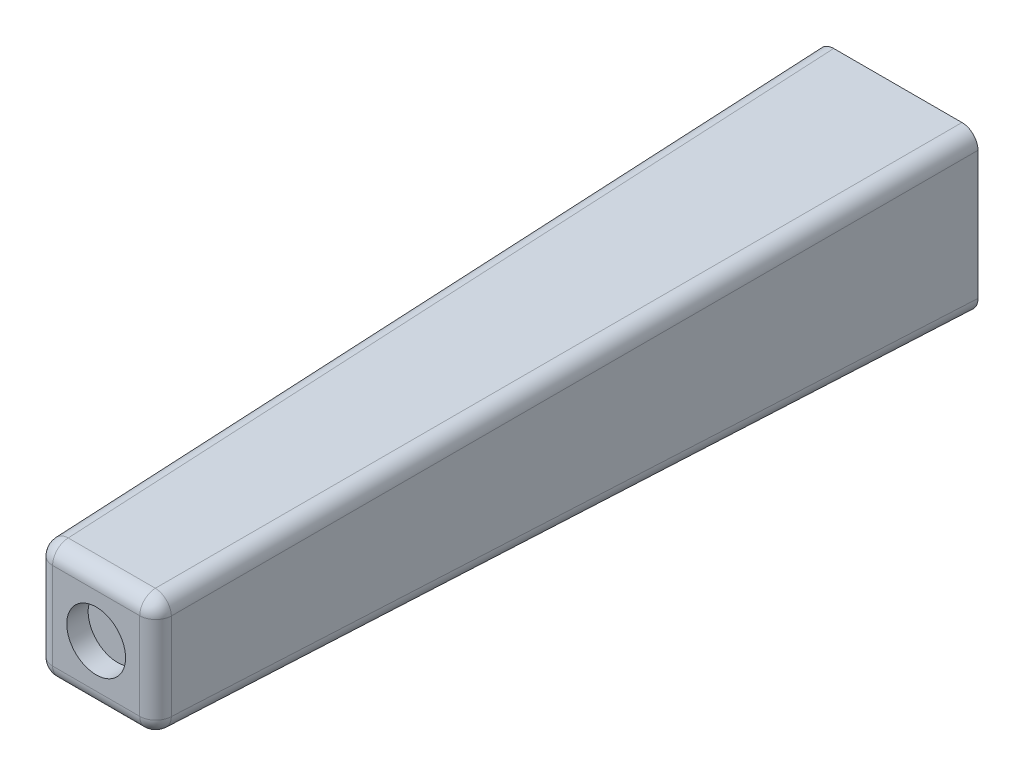
ISO-10303-21;
HEADER;
FILE_DESCRIPTION(('STEP AP214'),'2;1');
FILE_NAME('part.step','',(''),(''),'','','');
FILE_SCHEMA(('AUTOMOTIVE_DESIGN { 1 0 10303 214 1 1 1 1 }'));
ENDSEC;
DATA;
#1=APPLICATION_CONTEXT('core data for automotive mechanical design processes');
#2=APPLICATION_PROTOCOL_DEFINITION('international standard','automotive_design',2000,#1);
#3=PRODUCT_CONTEXT('',#1,'mechanical');
#4=PRODUCT('Part','Part','',(#3));
#5=PRODUCT_RELATED_PRODUCT_CATEGORY('part','',(#4));
#6=PRODUCT_DEFINITION_FORMATION('','',#4);
#7=PRODUCT_DEFINITION_CONTEXT('part definition',#1,'design');
#8=PRODUCT_DEFINITION('design','',#6,#7);
#9=PRODUCT_DEFINITION_SHAPE('','',#8);
#10=(LENGTH_UNIT() NAMED_UNIT(*) SI_UNIT(.MILLI.,.METRE.));
#11=(NAMED_UNIT(*) PLANE_ANGLE_UNIT() SI_UNIT($,.RADIAN.));
#12=(NAMED_UNIT(*) SI_UNIT($,.STERADIAN.) SOLID_ANGLE_UNIT());
#13=UNCERTAINTY_MEASURE_WITH_UNIT(LENGTH_MEASURE(1.E-05),#10,'distance_accuracy_value','');
#14=(GEOMETRIC_REPRESENTATION_CONTEXT(3) GLOBAL_UNCERTAINTY_ASSIGNED_CONTEXT((#13)) GLOBAL_UNIT_ASSIGNED_CONTEXT((#10,
#11,#12)) REPRESENTATION_CONTEXT('',''));
#15=CARTESIAN_POINT('',(0.,0.,0.));
#16=DIRECTION('',(0.,0.,1.));
#17=DIRECTION('',(1.,0.,0.));
#18=AXIS2_PLACEMENT_3D('',#15,#16,#17);
#19=CARTESIAN_POINT('',(7.5,-7.5,0.));
#20=DIRECTION('',(0.999657324975557,0.,0.0261769483078732));
#21=DIRECTION('',(0.0261769483078732,0.,-0.999657324975557));
#22=AXIS2_PLACEMENT_3D('',#19,#20,#21);
#23=PLANE('',#22);
#24=DIRECTION('',(0.,1.,0.));
#25=VECTOR('',#24,1.);
#26=CARTESIAN_POINT('',(7.5,-7.5,0.));
#27=LINE('',#26,#25);
#28=CARTESIAN_POINT('',(7.5,-6.00051401253666,0.));
#29=VERTEX_POINT('',#28);
#30=CARTESIAN_POINT('',(7.5,6.00051401253666,0.));
#31=VERTEX_POINT('',#30);
#32=EDGE_CURVE('E300',#29,#31,#27,.T.);
#33=ORIENTED_EDGE('',*,*,#32,.T.);
#34=DIRECTION('',(-0.0261679842649794,-0.0261679842649794,0.99931500198837));
#35=VECTOR('',#34,1.);
#36=CARTESIAN_POINT('',(7.49075534211638,5.99126935465305,0.353039241303446));
#37=LINE('',#36,#35);
#38=CARTESIAN_POINT('',(5.57430656339179,4.07482057592846,73.5392654224618));
#39=VERTEX_POINT('',#38);
#40=EDGE_CURVE('E167',#31,#39,#37,.T.);
#41=ORIENTED_EDGE('',*,*,#40,.T.);
#42=DIRECTION('',(0.,1.,0.));
#43=VECTOR('',#42,1.);
#44=CARTESIAN_POINT('',(5.57430656339179,-7.5,73.5392654224618));
#45=LINE('',#44,#43);
#46=CARTESIAN_POINT('',(5.57430656339179,-4.07482057592845,73.5392654224618));
#47=VERTEX_POINT('',#46);
#48=EDGE_CURVE('E165',#39,#47,#45,.F.);
#49=ORIENTED_EDGE('',*,*,#48,.T.);
#50=DIRECTION('',(-0.0261679842649794,0.0261679842649794,0.99931500198837));
#51=VECTOR('',#50,1.);
#52=CARTESIAN_POINT('',(7.50102679312377,-6.00154080566043,-0.0392116474133964));
#53=LINE('',#52,#51);
#54=EDGE_CURVE('E163',#47,#29,#53,.F.);
#55=ORIENTED_EDGE('',*,*,#54,.T.);
#56=EDGE_LOOP('',(#33,#41,#49,#55));
#57=FACE_BOUND('',#56,.T.);
#58=ADVANCED_FACE('F41',(#57),#23,.T.);
#59=CARTESIAN_POINT('',(-7.5,7.5,0.));
#60=DIRECTION('',(0.,0.999657324975557,0.0261769483078732));
#61=DIRECTION('',(0.,-0.0261769483078732,0.999657324975557));
#62=AXIS2_PLACEMENT_3D('',#59,#60,#61);
#63=PLANE('',#62);
#64=DIRECTION('',(-1.,0.,0.));
#65=VECTOR('',#64,1.);
#66=CARTESIAN_POINT('',(-7.5,5.57430656339179,73.5392654224618));
#67=LINE('',#66,#65);
#68=CARTESIAN_POINT('',(-4.07482057592845,5.57430656339179,73.5392654224618));
#69=VERTEX_POINT('',#68);
#70=CARTESIAN_POINT('',(4.07482057592846,5.57430656339179,73.5392654224618));
#71=VERTEX_POINT('',#70);
#72=EDGE_CURVE('E125',#69,#71,#67,.F.);
#73=ORIENTED_EDGE('',*,*,#72,.T.);
#74=DIRECTION('',(-0.0261679842649794,-0.0261679842649794,0.99931500198837));
#75=VECTOR('',#74,1.);
#76=CARTESIAN_POINT('',(5.99126935465305,7.49075534211638,0.353039241303446));
#77=LINE('',#76,#75);
#78=CARTESIAN_POINT('',(6.00051401253666,7.5,0.));
#79=VERTEX_POINT('',#78);
#80=EDGE_CURVE('E161',#71,#79,#77,.F.);
#81=ORIENTED_EDGE('',*,*,#80,.T.);
#82=DIRECTION('',(-1.,0.,0.));
#83=VECTOR('',#82,1.);
#84=CARTESIAN_POINT('',(-7.5,7.5,0.));
#85=LINE('',#84,#83);
#86=CARTESIAN_POINT('',(-6.00051401253666,7.5,0.));
#87=VERTEX_POINT('',#86);
#88=EDGE_CURVE('E305',#79,#87,#85,.T.);
#89=ORIENTED_EDGE('',*,*,#88,.T.);
#90=DIRECTION('',(0.0261679842649794,-0.0261679842649794,0.99931500198837));
#91=VECTOR('',#90,1.);
#92=CARTESIAN_POINT('',(-6.00154080566043,7.50102679312376,-0.0392116474133964));
#93=LINE('',#92,#91);
#94=EDGE_CURVE('E154',#87,#69,#93,.T.);
#95=ORIENTED_EDGE('',*,*,#94,.T.);
#96=EDGE_LOOP('',(#73,#81,#89,#95));
#97=FACE_BOUND('',#96,.T.);
#98=ADVANCED_FACE('F225',(#97),#63,.T.);
#99=CARTESIAN_POINT('',(-7.5,-7.5,0.));
#100=DIRECTION('',(-0.999657324975557,0.,0.0261769483078732));
#101=DIRECTION('',(0.0261769483078732,0.,0.999657324975557));
#102=AXIS2_PLACEMENT_3D('',#99,#100,#101);
#103=PLANE('',#102);
#104=DIRECTION('',(0.,-1.,0.));
#105=VECTOR('',#104,1.);
#106=CARTESIAN_POINT('',(-7.5,-7.5,0.));
#107=LINE('',#106,#105);
#108=CARTESIAN_POINT('',(-7.5,6.00051401253666,0.));
#109=VERTEX_POINT('',#108);
#110=CARTESIAN_POINT('',(-7.5,-6.00051401253666,0.));
#111=VERTEX_POINT('',#110);
#112=EDGE_CURVE('E303',#109,#111,#107,.T.);
#113=ORIENTED_EDGE('',*,*,#112,.T.);
#114=DIRECTION('',(0.0261679842649794,0.0261679842649794,0.99931500198837));
#115=VECTOR('',#114,1.);
#116=CARTESIAN_POINT('',(-7.50102679312377,-6.00154080566043,-0.0392116474133964));
#117=LINE('',#116,#115);
#118=CARTESIAN_POINT('',(-5.57430656339179,-4.07482057592845,73.5392654224618));
#119=VERTEX_POINT('',#118);
#120=EDGE_CURVE('E56',#111,#119,#117,.T.);
#121=ORIENTED_EDGE('',*,*,#120,.T.);
#122=DIRECTION('',(0.,-1.,0.));
#123=VECTOR('',#122,1.);
#124=CARTESIAN_POINT('',(-5.57430656339179,-7.5,73.5392654224618));
#125=LINE('',#124,#123);
#126=CARTESIAN_POINT('',(-5.57430656339179,4.07482057592845,73.5392654224618));
#127=VERTEX_POINT('',#126);
#128=EDGE_CURVE('E61',#119,#127,#125,.F.);
#129=ORIENTED_EDGE('',*,*,#128,.T.);
#130=DIRECTION('',(0.0261679842649794,-0.0261679842649794,0.99931500198837));
#131=VECTOR('',#130,1.);
#132=CARTESIAN_POINT('',(-7.49075534211638,5.99126935465305,0.353039241303446));
#133=LINE('',#132,#131);
#134=EDGE_CURVE('E175',#127,#109,#133,.F.);
#135=ORIENTED_EDGE('',*,*,#134,.T.);
#136=EDGE_LOOP('',(#113,#121,#129,#135));
#137=FACE_BOUND('',#136,.T.);
#138=ADVANCED_FACE('F232',(#137),#103,.T.);
#139=CARTESIAN_POINT('',(-7.5,-7.5,0.));
#140=DIRECTION('',(0.,-0.999657324975557,0.0261769483078732));
#141=DIRECTION('',(0.,-0.0261769483078732,-0.999657324975557));
#142=AXIS2_PLACEMENT_3D('',#139,#140,#141);
#143=PLANE('',#142);
#144=DIRECTION('',(1.,0.,0.));
#145=VECTOR('',#144,1.);
#146=CARTESIAN_POINT('',(-7.5,-5.57430656339179,73.5392654224618));
#147=LINE('',#146,#145);
#148=CARTESIAN_POINT('',(4.07482057592846,-5.57430656339179,73.5392654224618));
#149=VERTEX_POINT('',#148);
#150=CARTESIAN_POINT('',(-4.07482057592845,-5.57430656339179,73.5392654224618));
#151=VERTEX_POINT('',#150);
#152=EDGE_CURVE('E171',#149,#151,#147,.F.);
#153=ORIENTED_EDGE('',*,*,#152,.T.);
#154=DIRECTION('',(0.0261679842649794,0.0261679842649794,0.99931500198837));
#155=VECTOR('',#154,1.);
#156=CARTESIAN_POINT('',(-6.00154080566043,-7.50102679312377,-0.0392116474133964));
#157=LINE('',#156,#155);
#158=CARTESIAN_POINT('',(-6.00051401253666,-7.5,0.));
#159=VERTEX_POINT('',#158);
#160=EDGE_CURVE('E173',#151,#159,#157,.F.);
#161=ORIENTED_EDGE('',*,*,#160,.T.);
#162=DIRECTION('',(1.,0.,0.));
#163=VECTOR('',#162,1.);
#164=CARTESIAN_POINT('',(-7.5,-7.5,0.));
#165=LINE('',#164,#163);
#166=CARTESIAN_POINT('',(6.00051401253666,-7.5,0.));
#167=VERTEX_POINT('',#166);
#168=EDGE_CURVE('E147',#159,#167,#165,.T.);
#169=ORIENTED_EDGE('',*,*,#168,.T.);
#170=DIRECTION('',(-0.0261679842649794,0.0261679842649794,0.99931500198837));
#171=VECTOR('',#170,1.);
#172=CARTESIAN_POINT('',(5.99126935465305,-7.49075534211638,0.353039241303446));
#173=LINE('',#172,#171);
#174=EDGE_CURVE('E169',#167,#149,#173,.T.);
#175=ORIENTED_EDGE('',*,*,#174,.T.);
#176=EDGE_LOOP('',(#153,#161,#169,#175));
#177=FACE_BOUND('',#176,.T.);
#178=ADVANCED_FACE('F240',(#177),#143,.T.);
#179=CARTESIAN_POINT('',(0.,0.,75.));
#180=DIRECTION('',(0.,0.,-1.));
#181=DIRECTION('',(-1.,0.,0.));
#182=AXIS2_PLACEMENT_3D('',#179,#180,#181);
#183=PLANE('',#182);
#184=DIRECTION('',(0.,-1.,0.));
#185=VECTOR('',#184,1.);
#186=CARTESIAN_POINT('',(4.07482057592846,0.,75.));
#187=LINE('',#186,#185);
#188=CARTESIAN_POINT('',(4.07482057592846,-4.07482057592845,75.));
#189=VERTEX_POINT('',#188);
#190=CARTESIAN_POINT('',(4.07482057592846,4.07482057592845,75.));
#191=VERTEX_POINT('',#190);
#192=EDGE_CURVE('E152',#189,#191,#187,.F.);
#193=ORIENTED_EDGE('',*,*,#192,.T.);
#194=DIRECTION('',(1.,0.,0.));
#195=VECTOR('',#194,1.);
#196=CARTESIAN_POINT('',(0.,4.07482057592845,75.));
#197=LINE('',#196,#195);
#198=CARTESIAN_POINT('',(-4.07482057592845,4.07482057592845,75.));
#199=VERTEX_POINT('',#198);
#200=EDGE_CURVE('E123',#191,#199,#197,.F.);
#201=ORIENTED_EDGE('',*,*,#200,.T.);
#202=DIRECTION('',(0.,1.,0.));
#203=VECTOR('',#202,1.);
#204=CARTESIAN_POINT('',(-4.07482057592845,0.,75.));
#205=LINE('',#204,#203);
#206=CARTESIAN_POINT('',(-4.07482057592846,-4.07482057592845,75.));
#207=VERTEX_POINT('',#206);
#208=EDGE_CURVE('E140',#199,#207,#205,.F.);
#209=ORIENTED_EDGE('',*,*,#208,.T.);
#210=DIRECTION('',(-1.,0.,0.));
#211=VECTOR('',#210,1.);
#212=CARTESIAN_POINT('',(0.,-4.07482057592845,75.));
#213=LINE('',#212,#211);
#214=EDGE_CURVE('E146',#207,#189,#213,.F.);
#215=ORIENTED_EDGE('',*,*,#214,.T.);
#216=EDGE_LOOP('',(#193,#201,#209,#215));
#217=FACE_BOUND('',#216,.T.);
#218=CARTESIAN_POINT('',(0.,0.,75.));
#219=DIRECTION('',(0.,0.,1.));
#220=DIRECTION('',(1.,0.,0.));
#221=AXIS2_PLACEMENT_3D('',#218,#219,#220);
#222=CIRCLE('',#221,2.75);
#223=CARTESIAN_POINT('',(2.75,0.,75.));
#224=VERTEX_POINT('',#223);
#225=EDGE_CURVE('E209',#224,#224,#222,.T.);
#226=ORIENTED_EDGE('',*,*,#225,.F.);
#227=EDGE_LOOP('',(#226));
#228=FACE_BOUND('',#227,.T.);
#229=ADVANCED_FACE('F149',(#217,#228),#183,.F.);
#230=CARTESIAN_POINT('',(0.,0.,0.));
#231=DIRECTION('',(0.,0.,-1.));
#232=DIRECTION('',(-1.,0.,0.));
#233=AXIS2_PLACEMENT_3D('',#230,#231,#232);
#234=PLANE('',#233);
#235=CARTESIAN_POINT('',(0.,0.,0.));
#236=DIRECTION('',(0.,0.,-1.));
#237=DIRECTION('',(-1.,0.,0.));
#238=AXIS2_PLACEMENT_3D('',#235,#236,#237);
#239=CIRCLE('',#238,2.);
#240=CARTESIAN_POINT('',(-2.,0.,0.));
#241=VERTEX_POINT('',#240);
#242=EDGE_CURVE('E11',#241,#241,#239,.F.);
#243=ORIENTED_EDGE('',*,*,#242,.T.);
#244=EDGE_LOOP('',(#243));
#245=FACE_BOUND('',#244,.T.);
#246=ORIENTED_EDGE('',*,*,#168,.F.);
#247=CARTESIAN_POINT('',(-5.9994858112637,-5.9994858112637,0.));
#248=DIRECTION('',(0.,0.,-1.));
#249=DIRECTION('',(-0.707106781186548,-0.707106781186548,0.));
#250=AXIS2_PLACEMENT_3D('',#247,#248,#249);
#251=ELLIPSE('',#250,1.50102820133331,1.5);
#252=EDGE_CURVE('E185',#159,#111,#251,.T.);
#253=ORIENTED_EDGE('',*,*,#252,.T.);
#254=ORIENTED_EDGE('',*,*,#112,.F.);
#255=CARTESIAN_POINT('',(-5.9994858112637,5.9994858112637,0.));
#256=DIRECTION('',(0.,0.,-1.));
#257=DIRECTION('',(-0.707106781186548,0.707106781186548,0.));
#258=AXIS2_PLACEMENT_3D('',#255,#256,#257);
#259=ELLIPSE('',#258,1.50102820133331,1.5);
#260=EDGE_CURVE('E181',#109,#87,#259,.T.);
#261=ORIENTED_EDGE('',*,*,#260,.T.);
#262=ORIENTED_EDGE('',*,*,#88,.F.);
#263=CARTESIAN_POINT('',(5.9994858112637,5.9994858112637,0.));
#264=DIRECTION('',(0.,0.,-1.));
#265=DIRECTION('',(0.707106781186548,0.707106781186548,0.));
#266=AXIS2_PLACEMENT_3D('',#263,#264,#265);
#267=ELLIPSE('',#266,1.50102820133331,1.5);
#268=EDGE_CURVE('E183',#79,#31,#267,.T.);
#269=ORIENTED_EDGE('',*,*,#268,.T.);
#270=ORIENTED_EDGE('',*,*,#32,.F.);
#271=CARTESIAN_POINT('',(5.9994858112637,-5.9994858112637,0.));
#272=DIRECTION('',(0.,0.,-1.));
#273=DIRECTION('',(0.707106781186547,-0.707106781186548,0.));
#274=AXIS2_PLACEMENT_3D('',#271,#272,#273);
#275=ELLIPSE('',#274,1.50102820133331,1.5);
#276=EDGE_CURVE('E179',#29,#167,#275,.T.);
#277=ORIENTED_EDGE('',*,*,#276,.T.);
#278=EDGE_LOOP('',(#246,#253,#254,#261,#262,#269,#270,#277));
#279=FACE_BOUND('',#278,.T.);
#280=ADVANCED_FACE('F238',(#245,#279),#234,.T.);
#281=CARTESIAN_POINT('',(0.,0.,10.));
#282=DIRECTION('',(0.,0.,-1.));
#283=DIRECTION('',(-1.,0.,0.));
#284=AXIS2_PLACEMENT_3D('',#281,#282,#283);
#285=CYLINDRICAL_SURFACE('',#284,1.5);
#286=CARTESIAN_POINT('',(0.,0.,0.5));
#287=DIRECTION('',(0.,0.,-1.));
#288=DIRECTION('',(-1.,0.,0.));
#289=AXIS2_PLACEMENT_3D('',#286,#287,#288);
#290=CIRCLE('',#289,1.5);
#291=CARTESIAN_POINT('',(-1.5,0.,0.5));
#292=VERTEX_POINT('',#291);
#293=EDGE_CURVE('E49',#292,#292,#290,.T.);
#294=ORIENTED_EDGE('',*,*,#293,.T.);
#295=EDGE_LOOP('',(#294));
#296=FACE_BOUND('',#295,.T.);
#297=CARTESIAN_POINT('',(0.,0.,10.));
#298=DIRECTION('',(0.,0.,-1.));
#299=DIRECTION('',(-1.,0.,0.));
#300=AXIS2_PLACEMENT_3D('',#297,#298,#299);
#301=CIRCLE('',#300,1.5);
#302=CARTESIAN_POINT('',(-1.5,0.,10.));
#303=VERTEX_POINT('',#302);
#304=EDGE_CURVE('E322',#303,#303,#301,.T.);
#305=ORIENTED_EDGE('',*,*,#304,.F.);
#306=EDGE_LOOP('',(#305));
#307=FACE_BOUND('',#306,.T.);
#308=ADVANCED_FACE('F213',(#296,#307),#285,.F.);
#309=CARTESIAN_POINT('',(0.,0.,10.));
#310=DIRECTION('',(0.,0.,-1.));
#311=DIRECTION('',(-1.,0.,0.));
#312=AXIS2_PLACEMENT_3D('',#309,#310,#311);
#313=PLANE('',#312);
#314=ORIENTED_EDGE('',*,*,#304,.T.);
#315=EDGE_LOOP('',(#314));
#316=FACE_BOUND('',#315,.T.);
#317=ADVANCED_FACE('F335',(#316),#313,.T.);
#318=CARTESIAN_POINT('',(0.,0.,73.));
#319=DIRECTION('',(0.,0.,1.));
#320=DIRECTION('',(1.,0.,0.));
#321=AXIS2_PLACEMENT_3D('',#318,#319,#320);
#322=CYLINDRICAL_SURFACE('',#321,2.75);
#323=CARTESIAN_POINT('',(0.,0.,73.));
#324=DIRECTION('',(0.,0.,1.));
#325=DIRECTION('',(1.,0.,0.));
#326=AXIS2_PLACEMENT_3D('',#323,#324,#325);
#327=CIRCLE('',#326,2.75);
#328=CARTESIAN_POINT('',(2.75,0.,73.));
#329=VERTEX_POINT('',#328);
#330=EDGE_CURVE('E327',#329,#329,#327,.T.);
#331=ORIENTED_EDGE('',*,*,#330,.F.);
#332=EDGE_LOOP('',(#331));
#333=FACE_BOUND('',#332,.T.);
#334=ORIENTED_EDGE('',*,*,#225,.T.);
#335=EDGE_LOOP('',(#334));
#336=FACE_BOUND('',#335,.T.);
#337=ADVANCED_FACE('F288',(#333,#336),#322,.F.);
#338=CARTESIAN_POINT('',(0.,0.,73.));
#339=DIRECTION('',(0.,0.,1.));
#340=DIRECTION('',(1.,0.,0.));
#341=AXIS2_PLACEMENT_3D('',#338,#339,#340);
#342=PLANE('',#341);
#343=ORIENTED_EDGE('',*,*,#330,.T.);
#344=EDGE_LOOP('',(#343));
#345=FACE_BOUND('',#344,.T.);
#346=ADVANCED_FACE('F283',(#345),#342,.T.);
#347=CARTESIAN_POINT('',(6.00154080566043,-6.00154080566043,-0.0784770698752062));
#348=DIRECTION('',(0.0261679842649794,-0.0261679842649794,-0.99931500198837));
#349=DIRECTION('',(0.,0.999657324975557,-0.0261769483078732));
#350=AXIS2_PLACEMENT_3D('',#347,#348,#349);
#351=CYLINDRICAL_SURFACE('',#350,1.5);
#352=ORIENTED_EDGE('',*,*,#276,.F.);
#353=ORIENTED_EDGE('',*,*,#54,.F.);
#354=CARTESIAN_POINT('',(4.07482057592846,-4.07482057592846,73.5));
#355=DIRECTION('',(-0.026167984264981,0.026167984264981,0.99931500198837));
#356=DIRECTION('',(0.999657324975557,0.,0.0261769483078748));
#357=AXIS2_PLACEMENT_3D('',#354,#355,#356);
#358=CIRCLE('',#357,1.5);
#359=EDGE_CURVE('E207',#149,#47,#358,.T.);
#360=ORIENTED_EDGE('',*,*,#359,.F.);
#361=ORIENTED_EDGE('',*,*,#174,.F.);
#362=EDGE_LOOP('',(#352,#353,#360,#361));
#363=FACE_BOUND('',#362,.T.);
#364=ADVANCED_FACE('F280',(#363),#351,.T.);
#365=CARTESIAN_POINT('',(0.,-4.07482057592845,73.5));
#366=DIRECTION('',(-1.,0.,0.));
#367=DIRECTION('',(0.,0.,1.));
#368=AXIS2_PLACEMENT_3D('',#365,#366,#367);
#369=CYLINDRICAL_SURFACE('',#368,1.5);
#370=CARTESIAN_POINT('',(-4.07482057592845,-4.07482057592846,73.5));
#371=DIRECTION('',(-1.,0.,0.));
#372=DIRECTION('',(0.,0.,1.));
#373=AXIS2_PLACEMENT_3D('',#370,#371,#372);
#374=CIRCLE('',#373,1.5);
#375=EDGE_CURVE('E201',#151,#207,#374,.T.);
#376=ORIENTED_EDGE('',*,*,#375,.F.);
#377=ORIENTED_EDGE('',*,*,#152,.F.);
#378=CARTESIAN_POINT('',(4.07482057592846,-4.07482057592845,73.5));
#379=DIRECTION('',(1.,0.,0.));
#380=DIRECTION('',(0.,1.,0.));
#381=AXIS2_PLACEMENT_3D('',#378,#379,#380);
#382=CIRCLE('',#381,1.5);
#383=EDGE_CURVE('E204',#189,#149,#382,.T.);
#384=ORIENTED_EDGE('',*,*,#383,.F.);
#385=ORIENTED_EDGE('',*,*,#214,.F.);
#386=EDGE_LOOP('',(#376,#377,#384,#385));
#387=FACE_BOUND('',#386,.T.);
#388=ADVANCED_FACE('F277',(#387),#369,.T.);
#389=CARTESIAN_POINT('',(-6.00154080566043,-6.00154080566043,-0.0784770698752062));
#390=DIRECTION('',(-0.0261679842649794,-0.0261679842649794,-0.99931500198837));
#391=DIRECTION('',(-0.999657324975557,0.,0.0261769483078732));
#392=AXIS2_PLACEMENT_3D('',#389,#390,#391);
#393=CYLINDRICAL_SURFACE('',#392,1.5);
#394=ORIENTED_EDGE('',*,*,#252,.F.);
#395=ORIENTED_EDGE('',*,*,#160,.F.);
#396=CARTESIAN_POINT('',(-4.07482057592845,-4.07482057592845,73.5));
#397=DIRECTION('',(0.026167984264981,0.026167984264981,0.99931500198837));
#398=DIRECTION('',(0.999657324975557,0.,-0.0261769483078748));
#399=AXIS2_PLACEMENT_3D('',#396,#397,#398);
#400=CIRCLE('',#399,1.5);
#401=EDGE_CURVE('E198',#119,#151,#400,.T.);
#402=ORIENTED_EDGE('',*,*,#401,.F.);
#403=ORIENTED_EDGE('',*,*,#120,.F.);
#404=EDGE_LOOP('',(#394,#395,#402,#403));
#405=FACE_BOUND('',#404,.T.);
#406=ADVANCED_FACE('F273',(#405),#393,.T.);
#407=CARTESIAN_POINT('',(4.07482057592846,-4.07482057592845,73.5));
#408=DIRECTION('',(0.,0.,1.));
#409=DIRECTION('',(1.,0.,0.));
#410=AXIS2_PLACEMENT_3D('',#407,#408,#409);
#411=SPHERICAL_SURFACE('',#410,1.5);
#412=ORIENTED_EDGE('',*,*,#383,.T.);
#413=ORIENTED_EDGE('',*,*,#359,.T.);
#414=CARTESIAN_POINT('',(4.07482057592846,-4.07482057592845,73.5));
#415=DIRECTION('',(0.,-1.,0.));
#416=DIRECTION('',(0.,0.,-1.));
#417=AXIS2_PLACEMENT_3D('',#414,#415,#416);
#418=CIRCLE('',#417,1.5);
#419=EDGE_CURVE('E195',#189,#47,#418,.F.);
#420=ORIENTED_EDGE('',*,*,#419,.F.);
#421=EDGE_LOOP('',(#412,#413,#420));
#422=FACE_BOUND('',#421,.T.);
#423=ADVANCED_FACE('F269',(#422),#411,.T.);
#424=CARTESIAN_POINT('',(-4.07482057592845,-4.07482057592845,73.5));
#425=DIRECTION('',(0.,0.,1.));
#426=DIRECTION('',(1.,0.,0.));
#427=AXIS2_PLACEMENT_3D('',#424,#425,#426);
#428=SPHERICAL_SURFACE('',#427,1.5);
#429=ORIENTED_EDGE('',*,*,#401,.T.);
#430=ORIENTED_EDGE('',*,*,#375,.T.);
#431=CARTESIAN_POINT('',(-4.07482057592846,-4.07482057592845,73.5));
#432=DIRECTION('',(0.,-1.,0.));
#433=DIRECTION('',(0.,0.,-1.));
#434=AXIS2_PLACEMENT_3D('',#431,#432,#433);
#435=CIRCLE('',#434,1.5);
#436=EDGE_CURVE('E143',#119,#207,#435,.F.);
#437=ORIENTED_EDGE('',*,*,#436,.F.);
#438=EDGE_LOOP('',(#429,#430,#437));
#439=FACE_BOUND('',#438,.T.);
#440=ADVANCED_FACE('F265',(#439),#428,.T.);
#441=CARTESIAN_POINT('',(5.99126935465305,5.99126935465305,0.313773818841637));
#442=DIRECTION('',(0.0261679842649794,0.0261679842649794,-0.99931500198837));
#443=DIRECTION('',(-0.999657324975557,0.,-0.0261769483078732));
#444=AXIS2_PLACEMENT_3D('',#441,#442,#443);
#445=CYLINDRICAL_SURFACE('',#444,1.5);
#446=ORIENTED_EDGE('',*,*,#268,.F.);
#447=ORIENTED_EDGE('',*,*,#80,.F.);
#448=CARTESIAN_POINT('',(4.07482057592846,4.07482057592846,73.5));
#449=DIRECTION('',(-0.026167984264981,-0.026167984264981,0.99931500198837));
#450=DIRECTION('',(0.,-0.999657324975557,-0.0261769483078748));
#451=AXIS2_PLACEMENT_3D('',#448,#449,#450);
#452=CIRCLE('',#451,1.5);
#453=EDGE_CURVE('E191',#39,#71,#452,.T.);
#454=ORIENTED_EDGE('',*,*,#453,.F.);
#455=ORIENTED_EDGE('',*,*,#40,.F.);
#456=EDGE_LOOP('',(#446,#447,#454,#455));
#457=FACE_BOUND('',#456,.T.);
#458=ADVANCED_FACE('F261',(#457),#445,.T.);
#459=CARTESIAN_POINT('',(4.07482057592846,0.,73.5));
#460=DIRECTION('',(0.,-1.,0.));
#461=DIRECTION('',(1.,0.,0.));
#462=AXIS2_PLACEMENT_3D('',#459,#460,#461);
#463=CYLINDRICAL_SURFACE('',#462,1.5);
#464=ORIENTED_EDGE('',*,*,#419,.T.);
#465=ORIENTED_EDGE('',*,*,#48,.F.);
#466=CARTESIAN_POINT('',(4.07482057592846,4.07482057592845,73.5));
#467=DIRECTION('',(0.,1.,0.));
#468=DIRECTION('',(-1.,0.,0.));
#469=AXIS2_PLACEMENT_3D('',#466,#467,#468);
#470=CIRCLE('',#469,1.5);
#471=EDGE_CURVE('E137',#191,#39,#470,.T.);
#472=ORIENTED_EDGE('',*,*,#471,.F.);
#473=ORIENTED_EDGE('',*,*,#192,.F.);
#474=EDGE_LOOP('',(#464,#465,#472,#473));
#475=FACE_BOUND('',#474,.T.);
#476=ADVANCED_FACE('F258',(#475),#463,.T.);
#477=CARTESIAN_POINT('',(-4.07482057592845,0.,73.5));
#478=DIRECTION('',(0.,1.,0.));
#479=DIRECTION('',(-1.,0.,0.));
#480=AXIS2_PLACEMENT_3D('',#477,#478,#479);
#481=CYLINDRICAL_SURFACE('',#480,1.5);
#482=ORIENTED_EDGE('',*,*,#436,.T.);
#483=ORIENTED_EDGE('',*,*,#208,.F.);
#484=CARTESIAN_POINT('',(-4.07482057592845,4.07482057592845,73.5));
#485=DIRECTION('',(0.,1.,0.));
#486=DIRECTION('',(0.,0.,1.));
#487=AXIS2_PLACEMENT_3D('',#484,#485,#486);
#488=CIRCLE('',#487,1.5);
#489=EDGE_CURVE('E131',#127,#199,#488,.T.);
#490=ORIENTED_EDGE('',*,*,#489,.F.);
#491=ORIENTED_EDGE('',*,*,#128,.F.);
#492=EDGE_LOOP('',(#482,#483,#490,#491));
#493=FACE_BOUND('',#492,.T.);
#494=ADVANCED_FACE('F141',(#493),#481,.T.);
#495=CARTESIAN_POINT('',(-5.99126935465305,5.99126935465305,0.313773818841636));
#496=DIRECTION('',(-0.0261679842649794,0.0261679842649794,-0.99931500198837));
#497=DIRECTION('',(-0.999657324975557,0.,0.0261769483078732));
#498=AXIS2_PLACEMENT_3D('',#495,#496,#497);
#499=CYLINDRICAL_SURFACE('',#498,1.5);
#500=ORIENTED_EDGE('',*,*,#260,.F.);
#501=ORIENTED_EDGE('',*,*,#134,.F.);
#502=CARTESIAN_POINT('',(-4.07482057592845,4.07482057592845,73.5));
#503=DIRECTION('',(0.026167984264981,-0.026167984264981,0.99931500198837));
#504=DIRECTION('',(0.999657324975557,0.,-0.0261769483078748));
#505=AXIS2_PLACEMENT_3D('',#502,#503,#504);
#506=CIRCLE('',#505,1.5);
#507=EDGE_CURVE('E135',#69,#127,#506,.T.);
#508=ORIENTED_EDGE('',*,*,#507,.F.);
#509=ORIENTED_EDGE('',*,*,#94,.F.);
#510=EDGE_LOOP('',(#500,#501,#508,#509));
#511=FACE_BOUND('',#510,.T.);
#512=ADVANCED_FACE('F251',(#511),#499,.T.);
#513=CARTESIAN_POINT('',(4.07482057592846,4.07482057592846,73.5));
#514=DIRECTION('',(0.,0.,1.));
#515=DIRECTION('',(1.,0.,0.));
#516=AXIS2_PLACEMENT_3D('',#513,#514,#515);
#517=SPHERICAL_SURFACE('',#516,1.5);
#518=ORIENTED_EDGE('',*,*,#471,.T.);
#519=ORIENTED_EDGE('',*,*,#453,.T.);
#520=CARTESIAN_POINT('',(4.07482057592846,4.07482057592846,73.5));
#521=DIRECTION('',(1.,0.,0.));
#522=DIRECTION('',(0.,0.,-1.));
#523=AXIS2_PLACEMENT_3D('',#520,#521,#522);
#524=CIRCLE('',#523,1.5);
#525=EDGE_CURVE('E128',#191,#71,#524,.F.);
#526=ORIENTED_EDGE('',*,*,#525,.F.);
#527=EDGE_LOOP('',(#518,#519,#526));
#528=FACE_BOUND('',#527,.T.);
#529=ADVANCED_FACE('F248',(#528),#517,.T.);
#530=CARTESIAN_POINT('',(-4.07482057592845,4.07482057592845,73.5));
#531=DIRECTION('',(0.,0.,1.));
#532=DIRECTION('',(1.,0.,0.));
#533=AXIS2_PLACEMENT_3D('',#530,#531,#532);
#534=SPHERICAL_SURFACE('',#533,1.5);
#535=ORIENTED_EDGE('',*,*,#507,.T.);
#536=ORIENTED_EDGE('',*,*,#489,.T.);
#537=CARTESIAN_POINT('',(-4.07482057592845,4.07482057592845,73.5));
#538=DIRECTION('',(-1.,0.,0.));
#539=DIRECTION('',(0.,-1.,0.));
#540=AXIS2_PLACEMENT_3D('',#537,#538,#539);
#541=CIRCLE('',#540,1.5);
#542=EDGE_CURVE('E119',#69,#199,#541,.F.);
#543=ORIENTED_EDGE('',*,*,#542,.F.);
#544=EDGE_LOOP('',(#535,#536,#543));
#545=FACE_BOUND('',#544,.T.);
#546=ADVANCED_FACE('F133',(#545),#534,.T.);
#547=CARTESIAN_POINT('',(0.,4.07482057592845,73.5));
#548=DIRECTION('',(1.,0.,0.));
#549=DIRECTION('',(0.,1.,0.));
#550=AXIS2_PLACEMENT_3D('',#547,#548,#549);
#551=CYLINDRICAL_SURFACE('',#550,1.5);
#552=ORIENTED_EDGE('',*,*,#525,.T.);
#553=ORIENTED_EDGE('',*,*,#72,.F.);
#554=ORIENTED_EDGE('',*,*,#542,.T.);
#555=ORIENTED_EDGE('',*,*,#200,.F.);
#556=EDGE_LOOP('',(#552,#553,#554,#555));
#557=FACE_BOUND('',#556,.T.);
#558=ADVANCED_FACE('F121',(#557),#551,.T.);
#559=CARTESIAN_POINT('',(0.,0.,0.5));
#560=DIRECTION('',(0.,0.,-1.));
#561=DIRECTION('',(-1.,0.,0.));
#562=AXIS2_PLACEMENT_3D('',#559,#560,#561);
#563=TOROIDAL_SURFACE('',#562,2.,0.5);
#564=ORIENTED_EDGE('',*,*,#242,.F.);
#565=EDGE_LOOP('',(#564));
#566=FACE_BOUND('',#565,.T.);
#567=ORIENTED_EDGE('',*,*,#293,.F.);
#568=EDGE_LOOP('',(#567));
#569=FACE_BOUND('',#568,.T.);
#570=ADVANCED_FACE('F43',(#566,#569),#563,.T.);
#571=CLOSED_SHELL('',(#58,#98,#138,#178,#229,#280,#308,#317,#337,#346,#364,#388,#406,#423,#440,
#458,#476,#494,#512,#529,#546,#558,#570));
#572=MANIFOLD_SOLID_BREP('B2',#571);
#573=ADVANCED_BREP_SHAPE_REPRESENTATION('',(#18,#572),#14);
#574=SHAPE_DEFINITION_REPRESENTATION(#9,#573);
ENDSEC;
END-ISO-10303-21;
